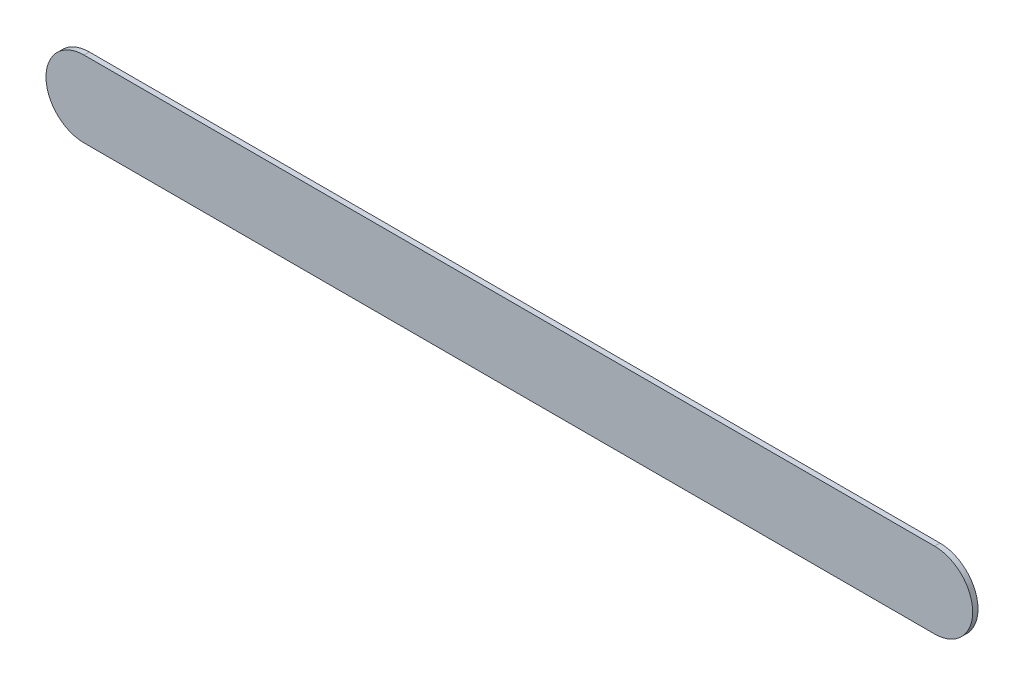
ISO-10303-21;
HEADER;
FILE_DESCRIPTION(('STEP AP214'),'2;1');
FILE_NAME('part.step','',(''),(''),'','','');
FILE_SCHEMA(('AUTOMOTIVE_DESIGN { 1 0 10303 214 1 1 1 1 }'));
ENDSEC;
DATA;
#1=APPLICATION_CONTEXT('core data for automotive mechanical design processes');
#2=APPLICATION_PROTOCOL_DEFINITION('international standard','automotive_design',2000,#1);
#3=PRODUCT_CONTEXT('',#1,'mechanical');
#4=PRODUCT('Part','Part','',(#3));
#5=PRODUCT_RELATED_PRODUCT_CATEGORY('part','',(#4));
#6=PRODUCT_DEFINITION_FORMATION('','',#4);
#7=PRODUCT_DEFINITION_CONTEXT('part definition',#1,'design');
#8=PRODUCT_DEFINITION('design','',#6,#7);
#9=PRODUCT_DEFINITION_SHAPE('','',#8);
#10=(LENGTH_UNIT() NAMED_UNIT(*) SI_UNIT(.MILLI.,.METRE.));
#11=(NAMED_UNIT(*) PLANE_ANGLE_UNIT() SI_UNIT($,.RADIAN.));
#12=(NAMED_UNIT(*) SI_UNIT($,.STERADIAN.) SOLID_ANGLE_UNIT());
#13=UNCERTAINTY_MEASURE_WITH_UNIT(LENGTH_MEASURE(1.E-05),#10,'distance_accuracy_value','');
#14=(GEOMETRIC_REPRESENTATION_CONTEXT(3) GLOBAL_UNCERTAINTY_ASSIGNED_CONTEXT((#13)) GLOBAL_UNIT_ASSIGNED_CONTEXT((#10,
#11,#12)) REPRESENTATION_CONTEXT('',''));
#15=CARTESIAN_POINT('',(0.,0.,0.));
#16=DIRECTION('',(0.,0.,1.));
#17=DIRECTION('',(1.,0.,0.));
#18=AXIS2_PLACEMENT_3D('',#15,#16,#17);
#19=CARTESIAN_POINT('',(135.763,-109.343,0.));
#20=DIRECTION('',(0.,0.,1.));
#21=DIRECTION('',(1.,0.,0.));
#22=AXIS2_PLACEMENT_3D('',#19,#20,#21);
#23=PLANE('',#22);
#24=DIRECTION('',(1.,0.,0.));
#25=VECTOR('',#24,1.);
#26=CARTESIAN_POINT('',(135.763,-109.343,0.));
#27=LINE('',#26,#25);
#28=CARTESIAN_POINT('',(135.763,-109.343,0.));
#29=VERTEX_POINT('',#28);
#30=CARTESIAN_POINT('',(141.351,-109.343,0.));
#31=VERTEX_POINT('',#30);
#32=EDGE_CURVE('E82',#29,#31,#27,.T.);
#33=ORIENTED_EDGE('',*,*,#32,.T.);
#34=CARTESIAN_POINT('',(141.351,-109.093,0.));
#35=DIRECTION('',(0.,0.,1.));
#36=DIRECTION('',(0.,-1.,0.));
#37=AXIS2_PLACEMENT_3D('',#34,#35,#36);
#38=CIRCLE('',#37,0.25);
#39=CARTESIAN_POINT('',(141.351,-108.843,0.));
#40=VERTEX_POINT('',#39);
#41=EDGE_CURVE('E98',#31,#40,#38,.T.);
#42=ORIENTED_EDGE('',*,*,#41,.T.);
#43=DIRECTION('',(-1.,0.,0.));
#44=VECTOR('',#43,1.);
#45=CARTESIAN_POINT('',(141.351,-108.843,0.));
#46=LINE('',#45,#44);
#47=CARTESIAN_POINT('',(135.763,-108.843,0.));
#48=VERTEX_POINT('',#47);
#49=EDGE_CURVE('E75',#40,#48,#46,.T.);
#50=ORIENTED_EDGE('',*,*,#49,.T.);
#51=CARTESIAN_POINT('',(135.763,-109.093,0.));
#52=DIRECTION('',(0.,0.,1.));
#53=DIRECTION('',(0.,1.,0.));
#54=AXIS2_PLACEMENT_3D('',#51,#52,#53);
#55=CIRCLE('',#54,0.25);
#56=EDGE_CURVE('E11',#48,#29,#55,.T.);
#57=ORIENTED_EDGE('',*,*,#56,.T.);
#58=EDGE_LOOP('',(#33,#42,#50,#57));
#59=FACE_BOUND('',#58,.T.);
#60=ADVANCED_FACE('F17',(#59),#23,.T.);
#61=CARTESIAN_POINT('',(135.763,-109.343,-0.035));
#62=DIRECTION('',(0.,0.,1.));
#63=DIRECTION('',(1.,0.,0.));
#64=AXIS2_PLACEMENT_3D('',#61,#62,#63);
#65=PLANE('',#64);
#66=CARTESIAN_POINT('',(135.763,-109.093,-0.035));
#67=DIRECTION('',(0.,0.,1.));
#68=DIRECTION('',(0.,1.,0.));
#69=AXIS2_PLACEMENT_3D('',#66,#67,#68);
#70=CIRCLE('',#69,0.25);
#71=CARTESIAN_POINT('',(135.763,-108.843,-0.035));
#72=VERTEX_POINT('',#71);
#73=CARTESIAN_POINT('',(135.763,-109.343,-0.035));
#74=VERTEX_POINT('',#73);
#75=EDGE_CURVE('E21',#72,#74,#70,.T.);
#76=ORIENTED_EDGE('',*,*,#75,.F.);
#77=DIRECTION('',(-1.,0.,0.));
#78=VECTOR('',#77,1.);
#79=CARTESIAN_POINT('',(141.351,-108.843,-0.035));
#80=LINE('',#79,#78);
#81=CARTESIAN_POINT('',(141.351,-108.843,-0.035));
#82=VERTEX_POINT('',#81);
#83=EDGE_CURVE('E108',#82,#72,#80,.T.);
#84=ORIENTED_EDGE('',*,*,#83,.F.);
#85=CARTESIAN_POINT('',(141.351,-109.093,-0.035));
#86=DIRECTION('',(0.,0.,1.));
#87=DIRECTION('',(0.,-1.,0.));
#88=AXIS2_PLACEMENT_3D('',#85,#86,#87);
#89=CIRCLE('',#88,0.25);
#90=CARTESIAN_POINT('',(141.351,-109.343,-0.035));
#91=VERTEX_POINT('',#90);
#92=EDGE_CURVE('E84',#91,#82,#89,.T.);
#93=ORIENTED_EDGE('',*,*,#92,.F.);
#94=DIRECTION('',(1.,0.,0.));
#95=VECTOR('',#94,1.);
#96=CARTESIAN_POINT('',(135.763,-109.343,-0.035));
#97=LINE('',#96,#95);
#98=EDGE_CURVE('E80',#74,#91,#97,.T.);
#99=ORIENTED_EDGE('',*,*,#98,.F.);
#100=EDGE_LOOP('',(#76,#84,#93,#99));
#101=FACE_BOUND('',#100,.T.);
#102=ADVANCED_FACE('F86',(#101),#65,.F.);
#103=CARTESIAN_POINT('',(135.763,-109.093,-0.035));
#104=DIRECTION('',(0.,0.,-1.));
#105=DIRECTION('',(0.,1.,0.));
#106=AXIS2_PLACEMENT_3D('',#103,#104,#105);
#107=CYLINDRICAL_SURFACE('',#106,0.25);
#108=ORIENTED_EDGE('',*,*,#75,.T.);
#109=DIRECTION('',(0.,0.,1.));
#110=VECTOR('',#109,1.);
#111=CARTESIAN_POINT('',(135.763,-109.343,-0.035));
#112=LINE('',#111,#110);
#113=EDGE_CURVE('E69',#74,#29,#112,.T.);
#114=ORIENTED_EDGE('',*,*,#113,.T.);
#115=ORIENTED_EDGE('',*,*,#56,.F.);
#116=DIRECTION('',(0.,0.,1.));
#117=VECTOR('',#116,1.);
#118=CARTESIAN_POINT('',(135.763,-108.843,-0.035));
#119=LINE('',#118,#117);
#120=EDGE_CURVE('E72',#72,#48,#119,.T.);
#121=ORIENTED_EDGE('',*,*,#120,.F.);
#122=EDGE_LOOP('',(#108,#114,#115,#121));
#123=FACE_BOUND('',#122,.T.);
#124=ADVANCED_FACE('F19',(#123),#107,.T.);
#125=CARTESIAN_POINT('',(141.351,-108.843,-0.035));
#126=DIRECTION('',(0.,-1.,0.));
#127=DIRECTION('',(0.,0.,-1.));
#128=AXIS2_PLACEMENT_3D('',#125,#126,#127);
#129=PLANE('',#128);
#130=ORIENTED_EDGE('',*,*,#83,.T.);
#131=ORIENTED_EDGE('',*,*,#120,.T.);
#132=ORIENTED_EDGE('',*,*,#49,.F.);
#133=DIRECTION('',(0.,0.,1.));
#134=VECTOR('',#133,1.);
#135=CARTESIAN_POINT('',(141.351,-108.843,-0.035));
#136=LINE('',#135,#134);
#137=EDGE_CURVE('E100',#82,#40,#136,.T.);
#138=ORIENTED_EDGE('',*,*,#137,.F.);
#139=EDGE_LOOP('',(#130,#131,#132,#138));
#140=FACE_BOUND('',#139,.T.);
#141=ADVANCED_FACE('F119',(#140),#129,.F.);
#142=CARTESIAN_POINT('',(141.351,-109.093,-0.035));
#143=DIRECTION('',(0.,0.,-1.));
#144=DIRECTION('',(0.,-1.,0.));
#145=AXIS2_PLACEMENT_3D('',#142,#143,#144);
#146=CYLINDRICAL_SURFACE('',#145,0.25);
#147=ORIENTED_EDGE('',*,*,#92,.T.);
#148=ORIENTED_EDGE('',*,*,#137,.T.);
#149=ORIENTED_EDGE('',*,*,#41,.F.);
#150=DIRECTION('',(0.,0.,1.));
#151=VECTOR('',#150,1.);
#152=CARTESIAN_POINT('',(141.351,-109.343,-0.035));
#153=LINE('',#152,#151);
#154=EDGE_CURVE('E90',#91,#31,#153,.T.);
#155=ORIENTED_EDGE('',*,*,#154,.F.);
#156=EDGE_LOOP('',(#147,#148,#149,#155));
#157=FACE_BOUND('',#156,.T.);
#158=ADVANCED_FACE('F121',(#157),#146,.T.);
#159=CARTESIAN_POINT('',(135.763,-109.343,-0.035));
#160=DIRECTION('',(0.,1.,0.));
#161=DIRECTION('',(1.,0.,0.));
#162=AXIS2_PLACEMENT_3D('',#159,#160,#161);
#163=PLANE('',#162);
#164=ORIENTED_EDGE('',*,*,#98,.T.);
#165=ORIENTED_EDGE('',*,*,#154,.T.);
#166=ORIENTED_EDGE('',*,*,#32,.F.);
#167=ORIENTED_EDGE('',*,*,#113,.F.);
#168=EDGE_LOOP('',(#164,#165,#166,#167));
#169=FACE_BOUND('',#168,.T.);
#170=ADVANCED_FACE('F78',(#169),#163,.F.);
#171=CLOSED_SHELL('',(#60,#102,#124,#141,#158,#170));
#172=MANIFOLD_SOLID_BREP('B1',#171);
#173=ADVANCED_BREP_SHAPE_REPRESENTATION('',(#18,#172),#14);
#174=SHAPE_DEFINITION_REPRESENTATION(#9,#173);
ENDSEC;
END-ISO-10303-21;
